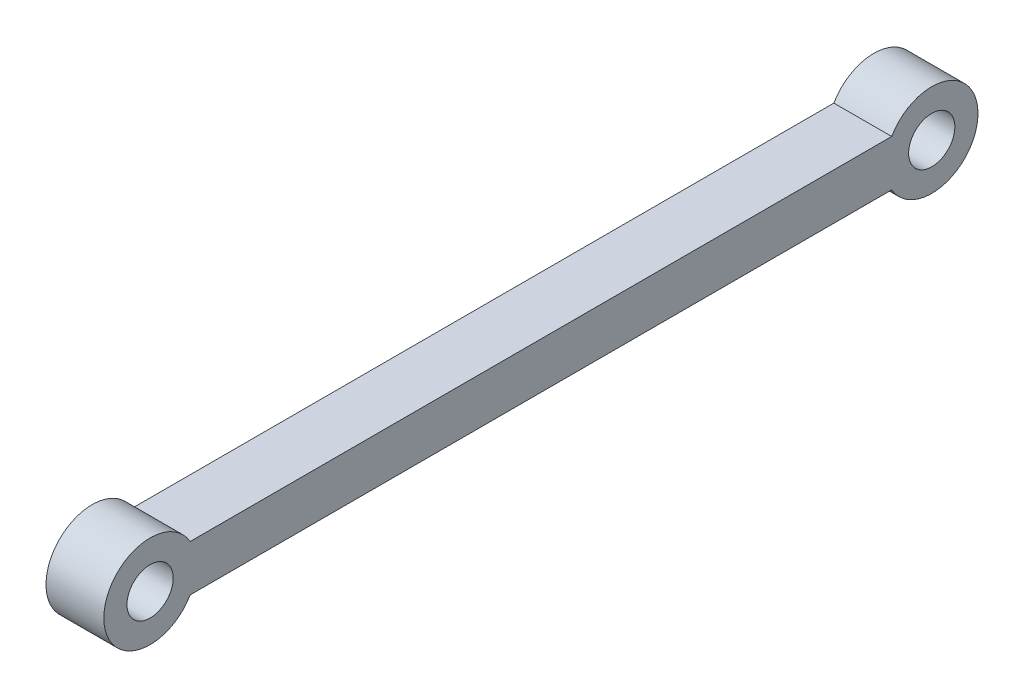
ISO-10303-21;
HEADER;
FILE_DESCRIPTION(('STEP AP214'),'2;1');
FILE_NAME('part.step','',(''),(''),'','','');
FILE_SCHEMA(('AUTOMOTIVE_DESIGN { 1 0 10303 214 1 1 1 1 }'));
ENDSEC;
DATA;
#1=APPLICATION_CONTEXT('core data for automotive mechanical design processes');
#2=APPLICATION_PROTOCOL_DEFINITION('international standard','automotive_design',2000,#1);
#3=PRODUCT_CONTEXT('',#1,'mechanical');
#4=PRODUCT('Part','Part','',(#3));
#5=PRODUCT_RELATED_PRODUCT_CATEGORY('part','',(#4));
#6=PRODUCT_DEFINITION_FORMATION('','',#4);
#7=PRODUCT_DEFINITION_CONTEXT('part definition',#1,'design');
#8=PRODUCT_DEFINITION('design','',#6,#7);
#9=PRODUCT_DEFINITION_SHAPE('','',#8);
#10=(LENGTH_UNIT() NAMED_UNIT(*) SI_UNIT(.MILLI.,.METRE.));
#11=(NAMED_UNIT(*) PLANE_ANGLE_UNIT() SI_UNIT($,.RADIAN.));
#12=(NAMED_UNIT(*) SI_UNIT($,.STERADIAN.) SOLID_ANGLE_UNIT());
#13=UNCERTAINTY_MEASURE_WITH_UNIT(LENGTH_MEASURE(1.E-05),#10,'distance_accuracy_value','');
#14=(GEOMETRIC_REPRESENTATION_CONTEXT(3) GLOBAL_UNCERTAINTY_ASSIGNED_CONTEXT((#13)) GLOBAL_UNIT_ASSIGNED_CONTEXT((#10,
#11,#12)) REPRESENTATION_CONTEXT('',''));
#15=CARTESIAN_POINT('',(0.,0.,0.));
#16=DIRECTION('',(0.,0.,1.));
#17=DIRECTION('',(1.,0.,0.));
#18=AXIS2_PLACEMENT_3D('',#15,#16,#17);
#19=CARTESIAN_POINT('',(1.25,-1.,-16.895));
#20=DIRECTION('',(1.,0.,0.));
#21=DIRECTION('',(0.,0.,-1.));
#22=AXIS2_PLACEMENT_3D('',#19,#20,#21);
#23=PLANE('',#22);
#24=CARTESIAN_POINT('',(1.25,-1.,16.895));
#25=DIRECTION('',(1.,0.,0.));
#26=DIRECTION('',(0.,0.,-1.));
#27=AXIS2_PLACEMENT_3D('',#24,#25,#26);
#28=CIRCLE('',#27,1.);
#29=CARTESIAN_POINT('',(1.25,-1.,15.895));
#30=VERTEX_POINT('',#29);
#31=EDGE_CURVE('E118',#30,#30,#28,.T.);
#32=ORIENTED_EDGE('',*,*,#31,.F.);
#33=EDGE_LOOP('',(#32));
#34=FACE_BOUND('',#33,.T.);
#35=CARTESIAN_POINT('',(1.25,-1.,-16.895));
#36=DIRECTION('',(1.,0.,0.));
#37=DIRECTION('',(0.,0.,-1.));
#38=AXIS2_PLACEMENT_3D('',#35,#36,#37);
#39=CIRCLE('',#38,2.);
#40=CARTESIAN_POINT('',(1.25,-2.,-15.1629491924311));
#41=VERTEX_POINT('',#40);
#42=CARTESIAN_POINT('',(1.25,0.,-15.1629491924311));
#43=VERTEX_POINT('',#42);
#44=EDGE_CURVE('E98',#41,#43,#39,.T.);
#45=ORIENTED_EDGE('',*,*,#44,.T.);
#46=DIRECTION('',(0.,0.,1.));
#47=VECTOR('',#46,1.);
#48=CARTESIAN_POINT('',(1.25,0.,15.1629491924311));
#49=LINE('',#48,#47);
#50=CARTESIAN_POINT('',(1.25,0.,15.1629491924311));
#51=VERTEX_POINT('',#50);
#52=EDGE_CURVE('E93',#43,#51,#49,.T.);
#53=ORIENTED_EDGE('',*,*,#52,.T.);
#54=CARTESIAN_POINT('',(1.25,-1.,16.895));
#55=DIRECTION('',(1.,0.,0.));
#56=DIRECTION('',(0.,0.,-1.));
#57=AXIS2_PLACEMENT_3D('',#54,#55,#56);
#58=CIRCLE('',#57,2.);
#59=CARTESIAN_POINT('',(1.25,-2.,15.1629491924311));
#60=VERTEX_POINT('',#59);
#61=EDGE_CURVE('E96',#51,#60,#58,.T.);
#62=ORIENTED_EDGE('',*,*,#61,.T.);
#63=DIRECTION('',(0.,0.,-1.));
#64=VECTOR('',#63,1.);
#65=CARTESIAN_POINT('',(1.25,-2.,15.1629491924311));
#66=LINE('',#65,#64);
#67=EDGE_CURVE('E63',#60,#41,#66,.T.);
#68=ORIENTED_EDGE('',*,*,#67,.T.);
#69=EDGE_LOOP('',(#45,#53,#62,#68));
#70=FACE_BOUND('',#69,.T.);
#71=CARTESIAN_POINT('',(1.25,-1.,-16.895));
#72=DIRECTION('',(1.,0.,0.));
#73=DIRECTION('',(0.,0.,-1.));
#74=AXIS2_PLACEMENT_3D('',#71,#72,#73);
#75=CIRCLE('',#74,1.00000000000001);
#76=CARTESIAN_POINT('',(1.25,-1.,-17.895));
#77=VERTEX_POINT('',#76);
#78=EDGE_CURVE('E140',#77,#77,#75,.T.);
#79=ORIENTED_EDGE('',*,*,#78,.F.);
#80=EDGE_LOOP('',(#79));
#81=FACE_BOUND('',#80,.T.);
#82=ADVANCED_FACE('F45',(#34,#70,#81),#23,.T.);
#83=CARTESIAN_POINT('',(-1.25,-1.,-16.895));
#84=DIRECTION('',(1.,0.,0.));
#85=DIRECTION('',(0.,0.,-1.));
#86=AXIS2_PLACEMENT_3D('',#83,#84,#85);
#87=PLANE('',#86);
#88=CARTESIAN_POINT('',(-1.25,-1.,-16.895));
#89=DIRECTION('',(1.,0.,0.));
#90=DIRECTION('',(0.,0.,-1.));
#91=AXIS2_PLACEMENT_3D('',#88,#89,#90);
#92=CIRCLE('',#91,2.);
#93=CARTESIAN_POINT('',(-1.25,-2.,-15.1629491924311));
#94=VERTEX_POINT('',#93);
#95=CARTESIAN_POINT('',(-1.25,0.,-15.1629491924311));
#96=VERTEX_POINT('',#95);
#97=EDGE_CURVE('E114',#94,#96,#92,.T.);
#98=ORIENTED_EDGE('',*,*,#97,.F.);
#99=DIRECTION('',(0.,0.,-1.));
#100=VECTOR('',#99,1.);
#101=CARTESIAN_POINT('',(-1.25,-2.,15.1629491924311));
#102=LINE('',#101,#100);
#103=CARTESIAN_POINT('',(-1.25,-2.,15.1629491924311));
#104=VERTEX_POINT('',#103);
#105=EDGE_CURVE('E86',#104,#94,#102,.T.);
#106=ORIENTED_EDGE('',*,*,#105,.F.);
#107=CARTESIAN_POINT('',(-1.25,-1.,16.895));
#108=DIRECTION('',(1.,0.,0.));
#109=DIRECTION('',(0.,0.,-1.));
#110=AXIS2_PLACEMENT_3D('',#107,#108,#109);
#111=CIRCLE('',#110,2.);
#112=CARTESIAN_POINT('',(-1.25,0.,15.1629491924311));
#113=VERTEX_POINT('',#112);
#114=EDGE_CURVE('E80',#113,#104,#111,.T.);
#115=ORIENTED_EDGE('',*,*,#114,.F.);
#116=DIRECTION('',(0.,0.,1.));
#117=VECTOR('',#116,1.);
#118=CARTESIAN_POINT('',(-1.25,0.,15.1629491924311));
#119=LINE('',#118,#117);
#120=EDGE_CURVE('E103',#96,#113,#119,.T.);
#121=ORIENTED_EDGE('',*,*,#120,.F.);
#122=EDGE_LOOP('',(#98,#106,#115,#121));
#123=FACE_BOUND('',#122,.T.);
#124=CARTESIAN_POINT('',(-1.25,-1.,16.895));
#125=DIRECTION('',(1.,0.,0.));
#126=DIRECTION('',(0.,0.,-1.));
#127=AXIS2_PLACEMENT_3D('',#124,#125,#126);
#128=CIRCLE('',#127,1.);
#129=CARTESIAN_POINT('',(-1.25,-1.,15.895));
#130=VERTEX_POINT('',#129);
#131=EDGE_CURVE('E136',#130,#130,#128,.T.);
#132=ORIENTED_EDGE('',*,*,#131,.T.);
#133=EDGE_LOOP('',(#132));
#134=FACE_BOUND('',#133,.T.);
#135=CARTESIAN_POINT('',(-1.25,-1.,-16.895));
#136=DIRECTION('',(1.,0.,0.));
#137=DIRECTION('',(0.,0.,-1.));
#138=AXIS2_PLACEMENT_3D('',#135,#136,#137);
#139=CIRCLE('',#138,1.00000000000001);
#140=CARTESIAN_POINT('',(-1.25,-1.,-17.895));
#141=VERTEX_POINT('',#140);
#142=EDGE_CURVE('E144',#141,#141,#139,.T.);
#143=ORIENTED_EDGE('',*,*,#142,.T.);
#144=EDGE_LOOP('',(#143));
#145=FACE_BOUND('',#144,.T.);
#146=ADVANCED_FACE('F131',(#123,#134,#145),#87,.F.);
#147=CARTESIAN_POINT('',(1.25,-1.,-16.895));
#148=DIRECTION('',(-1.,0.,0.));
#149=DIRECTION('',(0.,0.,1.));
#150=AXIS2_PLACEMENT_3D('',#147,#148,#149);
#151=CYLINDRICAL_SURFACE('',#150,2.);
#152=ORIENTED_EDGE('',*,*,#97,.T.);
#153=DIRECTION('',(-1.,0.,0.));
#154=VECTOR('',#153,1.);
#155=CARTESIAN_POINT('',(1.25,0.,-15.1629491924311));
#156=LINE('',#155,#154);
#157=EDGE_CURVE('E11',#43,#96,#156,.T.);
#158=ORIENTED_EDGE('',*,*,#157,.F.);
#159=ORIENTED_EDGE('',*,*,#44,.F.);
#160=DIRECTION('',(-1.,0.,0.));
#161=VECTOR('',#160,1.);
#162=CARTESIAN_POINT('',(1.25,-2.,-15.1629491924311));
#163=LINE('',#162,#161);
#164=EDGE_CURVE('E110',#41,#94,#163,.T.);
#165=ORIENTED_EDGE('',*,*,#164,.T.);
#166=EDGE_LOOP('',(#152,#158,#159,#165));
#167=FACE_BOUND('',#166,.T.);
#168=ADVANCED_FACE('F47',(#167),#151,.T.);
#169=CARTESIAN_POINT('',(1.25,0.,15.1629491924311));
#170=DIRECTION('',(0.,-1.,0.));
#171=DIRECTION('',(0.,0.,-1.));
#172=AXIS2_PLACEMENT_3D('',#169,#170,#171);
#173=PLANE('',#172);
#174=ORIENTED_EDGE('',*,*,#120,.T.);
#175=DIRECTION('',(-1.,0.,0.));
#176=VECTOR('',#175,1.);
#177=CARTESIAN_POINT('',(1.25,0.,15.1629491924311));
#178=LINE('',#177,#176);
#179=EDGE_CURVE('E55',#51,#113,#178,.T.);
#180=ORIENTED_EDGE('',*,*,#179,.F.);
#181=ORIENTED_EDGE('',*,*,#52,.F.);
#182=ORIENTED_EDGE('',*,*,#157,.T.);
#183=EDGE_LOOP('',(#174,#180,#181,#182));
#184=FACE_BOUND('',#183,.T.);
#185=ADVANCED_FACE('F102',(#184),#173,.F.);
#186=CARTESIAN_POINT('',(1.25,-1.,16.895));
#187=DIRECTION('',(-1.,0.,0.));
#188=DIRECTION('',(0.,0.,1.));
#189=AXIS2_PLACEMENT_3D('',#186,#187,#188);
#190=CYLINDRICAL_SURFACE('',#189,2.);
#191=ORIENTED_EDGE('',*,*,#114,.T.);
#192=DIRECTION('',(-1.,0.,0.));
#193=VECTOR('',#192,1.);
#194=CARTESIAN_POINT('',(1.25,-2.,15.1629491924311));
#195=LINE('',#194,#193);
#196=EDGE_CURVE('E105',#60,#104,#195,.T.);
#197=ORIENTED_EDGE('',*,*,#196,.F.);
#198=ORIENTED_EDGE('',*,*,#61,.F.);
#199=ORIENTED_EDGE('',*,*,#179,.T.);
#200=EDGE_LOOP('',(#191,#197,#198,#199));
#201=FACE_BOUND('',#200,.T.);
#202=ADVANCED_FACE('F106',(#201),#190,.T.);
#203=CARTESIAN_POINT('',(1.25,-2.,15.1629491924311));
#204=DIRECTION('',(0.,1.,0.));
#205=DIRECTION('',(0.,0.,1.));
#206=AXIS2_PLACEMENT_3D('',#203,#204,#205);
#207=PLANE('',#206);
#208=ORIENTED_EDGE('',*,*,#105,.T.);
#209=ORIENTED_EDGE('',*,*,#164,.F.);
#210=ORIENTED_EDGE('',*,*,#67,.F.);
#211=ORIENTED_EDGE('',*,*,#196,.T.);
#212=EDGE_LOOP('',(#208,#209,#210,#211));
#213=FACE_BOUND('',#212,.T.);
#214=ADVANCED_FACE('F128',(#213),#207,.F.);
#215=CARTESIAN_POINT('',(1.25,-1.,16.895));
#216=DIRECTION('',(-1.,0.,0.));
#217=DIRECTION('',(0.,0.,1.));
#218=AXIS2_PLACEMENT_3D('',#215,#216,#217);
#219=CYLINDRICAL_SURFACE('',#218,1.);
#220=ORIENTED_EDGE('',*,*,#31,.T.);
#221=EDGE_LOOP('',(#220));
#222=FACE_BOUND('',#221,.T.);
#223=ORIENTED_EDGE('',*,*,#131,.F.);
#224=EDGE_LOOP('',(#223));
#225=FACE_BOUND('',#224,.T.);
#226=ADVANCED_FACE('F163',(#222,#225),#219,.F.);
#227=CARTESIAN_POINT('',(1.25,-1.,-16.895));
#228=DIRECTION('',(-1.,0.,0.));
#229=DIRECTION('',(0.,0.,1.));
#230=AXIS2_PLACEMENT_3D('',#227,#228,#229);
#231=CYLINDRICAL_SURFACE('',#230,1.00000000000001);
#232=ORIENTED_EDGE('',*,*,#78,.T.);
#233=EDGE_LOOP('',(#232));
#234=FACE_BOUND('',#233,.T.);
#235=ORIENTED_EDGE('',*,*,#142,.F.);
#236=EDGE_LOOP('',(#235));
#237=FACE_BOUND('',#236,.T.);
#238=ADVANCED_FACE('F152',(#234,#237),#231,.F.);
#239=CLOSED_SHELL('',(#82,#146,#168,#185,#202,#214,#226,#238));
#240=MANIFOLD_SOLID_BREP('B2',#239);
#241=ADVANCED_BREP_SHAPE_REPRESENTATION('',(#18,#240),#14);
#242=SHAPE_DEFINITION_REPRESENTATION(#9,#241);
ENDSEC;
END-ISO-10303-21;
